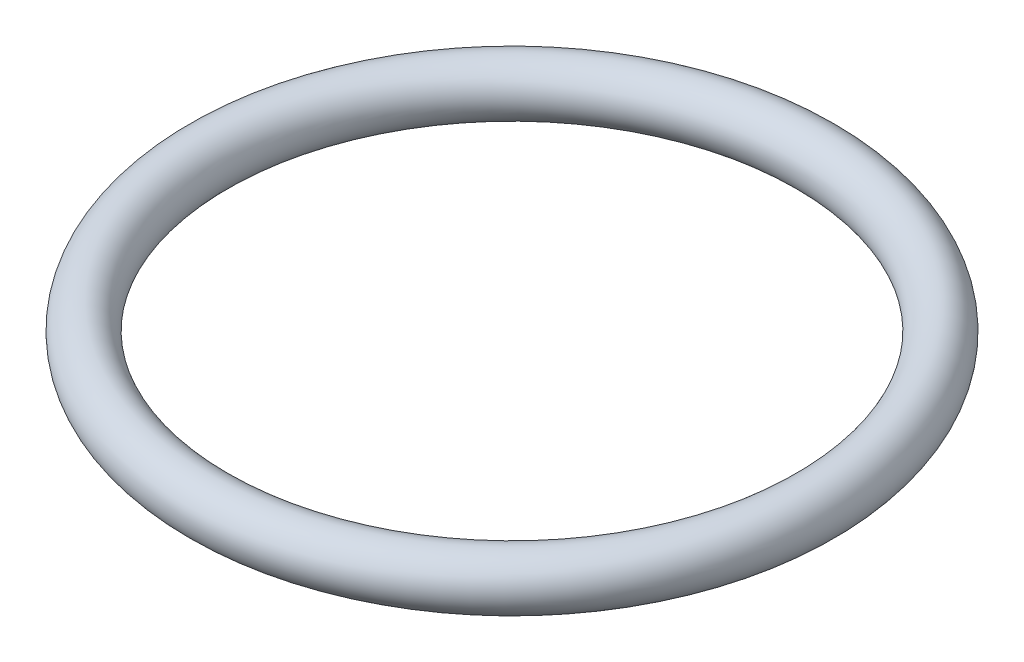
ISO-10303-21;
HEADER;
FILE_DESCRIPTION(('STEP AP214'),'2;1');
FILE_NAME('part.step','',(''),(''),'','','');
FILE_SCHEMA(('AUTOMOTIVE_DESIGN { 1 0 10303 214 1 1 1 1 }'));
ENDSEC;
DATA;
#1=APPLICATION_CONTEXT('core data for automotive mechanical design processes');
#2=APPLICATION_PROTOCOL_DEFINITION('international standard','automotive_design',2000,#1);
#3=PRODUCT_CONTEXT('',#1,'mechanical');
#4=PRODUCT('Part','Part','',(#3));
#5=PRODUCT_RELATED_PRODUCT_CATEGORY('part','',(#4));
#6=PRODUCT_DEFINITION_FORMATION('','',#4);
#7=PRODUCT_DEFINITION_CONTEXT('part definition',#1,'design');
#8=PRODUCT_DEFINITION('design','',#6,#7);
#9=PRODUCT_DEFINITION_SHAPE('','',#8);
#10=(LENGTH_UNIT() NAMED_UNIT(*) SI_UNIT(.MILLI.,.METRE.));
#11=(NAMED_UNIT(*) PLANE_ANGLE_UNIT() SI_UNIT($,.RADIAN.));
#12=(NAMED_UNIT(*) SI_UNIT($,.STERADIAN.) SOLID_ANGLE_UNIT());
#13=UNCERTAINTY_MEASURE_WITH_UNIT(LENGTH_MEASURE(1.E-05),#10,'distance_accuracy_value','');
#14=(GEOMETRIC_REPRESENTATION_CONTEXT(3) GLOBAL_UNCERTAINTY_ASSIGNED_CONTEXT((#13)) GLOBAL_UNIT_ASSIGNED_CONTEXT((#10,
#11,#12)) REPRESENTATION_CONTEXT('',''));
#15=CARTESIAN_POINT('',(0.,0.,0.));
#16=DIRECTION('',(0.,0.,1.));
#17=DIRECTION('',(1.,0.,0.));
#18=AXIS2_PLACEMENT_3D('',#15,#16,#17);
#19=CARTESIAN_POINT('',(0.,0.,0.));
#20=DIRECTION('',(0.,1.,0.));
#21=DIRECTION('',(0.,0.,1.));
#22=AXIS2_PLACEMENT_3D('',#19,#20,#21);
#23=TOROIDAL_SURFACE('',#22,28.5,2.5);
#24=CARTESIAN_POINT('',(0.,0.,31.));
#25=VERTEX_POINT('',#24);
#26=VERTEX_LOOP('',#25);
#27=FACE_BOUND('',#26,.T.);
#28=ADVANCED_FACE('F30',(#27),#23,.T.);
#29=CLOSED_SHELL('',(#28));
#30=MANIFOLD_SOLID_BREP('B2',#29);
#31=ADVANCED_BREP_SHAPE_REPRESENTATION('',(#18,#30),#14);
#32=SHAPE_DEFINITION_REPRESENTATION(#9,#31);
ENDSEC;
END-ISO-10303-21;
